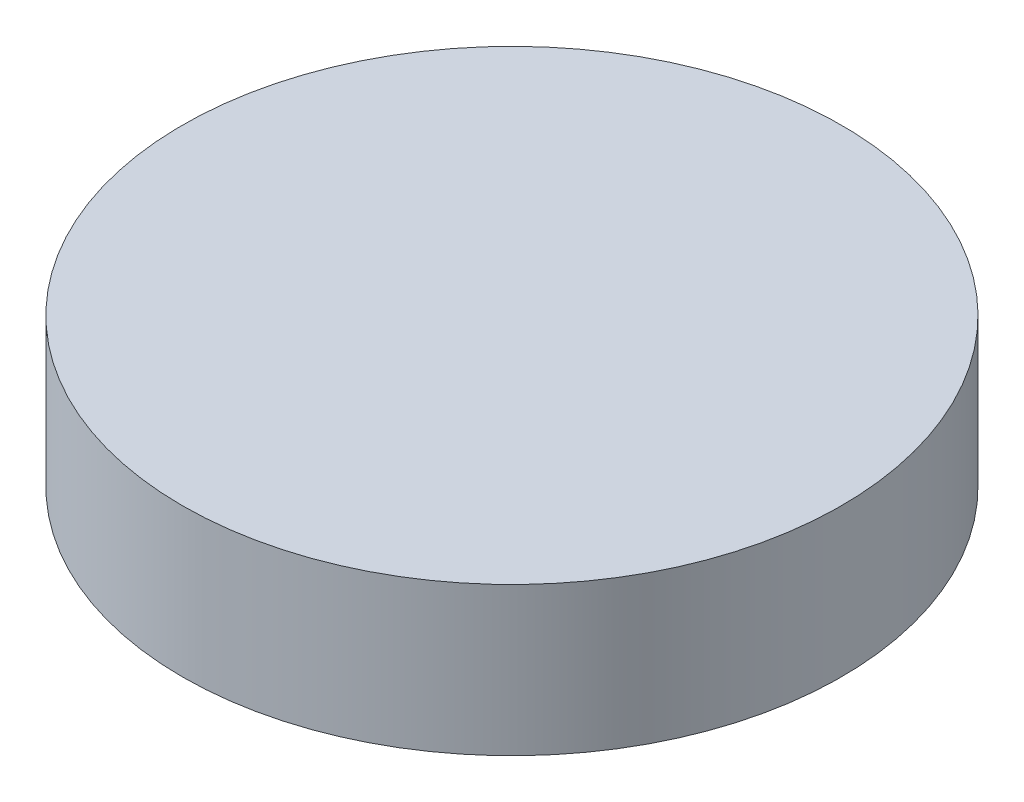
ISO-10303-21;
HEADER;
FILE_DESCRIPTION(('STEP AP214'),'2;1');
FILE_NAME('part.step','',(''),(''),'','','');
FILE_SCHEMA(('AUTOMOTIVE_DESIGN { 1 0 10303 214 1 1 1 1 }'));
ENDSEC;
DATA;
#1=APPLICATION_CONTEXT('core data for automotive mechanical design processes');
#2=APPLICATION_PROTOCOL_DEFINITION('international standard','automotive_design',2000,#1);
#3=PRODUCT_CONTEXT('',#1,'mechanical');
#4=PRODUCT('Part','Part','',(#3));
#5=PRODUCT_RELATED_PRODUCT_CATEGORY('part','',(#4));
#6=PRODUCT_DEFINITION_FORMATION('','',#4);
#7=PRODUCT_DEFINITION_CONTEXT('part definition',#1,'design');
#8=PRODUCT_DEFINITION('design','',#6,#7);
#9=PRODUCT_DEFINITION_SHAPE('','',#8);
#10=(LENGTH_UNIT() NAMED_UNIT(*) SI_UNIT(.MILLI.,.METRE.));
#11=(NAMED_UNIT(*) PLANE_ANGLE_UNIT() SI_UNIT($,.RADIAN.));
#12=(NAMED_UNIT(*) SI_UNIT($,.STERADIAN.) SOLID_ANGLE_UNIT());
#13=UNCERTAINTY_MEASURE_WITH_UNIT(LENGTH_MEASURE(1.E-05),#10,'distance_accuracy_value','');
#14=(GEOMETRIC_REPRESENTATION_CONTEXT(3) GLOBAL_UNCERTAINTY_ASSIGNED_CONTEXT((#13)) GLOBAL_UNIT_ASSIGNED_CONTEXT((#10,
#11,#12)) REPRESENTATION_CONTEXT('',''));
#15=CARTESIAN_POINT('',(0.,0.,0.));
#16=DIRECTION('',(0.,0.,1.));
#17=DIRECTION('',(1.,0.,0.));
#18=AXIS2_PLACEMENT_3D('',#15,#16,#17);
#19=CARTESIAN_POINT('',(0.,5.5118,0.));
#20=DIRECTION('',(0.,-1.,0.));
#21=DIRECTION('',(0.,0.,-1.));
#22=AXIS2_PLACEMENT_3D('',#19,#20,#21);
#23=CYLINDRICAL_SURFACE('',#22,12.25);
#24=CARTESIAN_POINT('',(0.,5.5118,0.));
#25=DIRECTION('',(0.,1.,0.));
#26=DIRECTION('',(0.,0.,1.));
#27=AXIS2_PLACEMENT_3D('',#24,#25,#26);
#28=CIRCLE('',#27,12.25);
#29=CARTESIAN_POINT('',(0.,5.5118,12.25));
#30=VERTEX_POINT('',#29);
#31=EDGE_CURVE('E10',#30,#30,#28,.T.);
#32=ORIENTED_EDGE('',*,*,#31,.F.);
#33=EDGE_LOOP('',(#32));
#34=FACE_BOUND('',#33,.T.);
#35=CARTESIAN_POINT('',(0.,0.,0.));
#36=DIRECTION('',(0.,1.,0.));
#37=DIRECTION('',(0.,0.,1.));
#38=AXIS2_PLACEMENT_3D('',#35,#36,#37);
#39=CIRCLE('',#38,12.25);
#40=CARTESIAN_POINT('',(0.,0.,12.25));
#41=VERTEX_POINT('',#40);
#42=EDGE_CURVE('E40',#41,#41,#39,.T.);
#43=ORIENTED_EDGE('',*,*,#42,.T.);
#44=EDGE_LOOP('',(#43));
#45=FACE_BOUND('',#44,.T.);
#46=ADVANCED_FACE('F37',(#34,#45),#23,.T.);
#47=CARTESIAN_POINT('',(0.,5.5118,0.));
#48=DIRECTION('',(0.,1.,0.));
#49=DIRECTION('',(0.,0.,1.));
#50=AXIS2_PLACEMENT_3D('',#47,#48,#49);
#51=PLANE('',#50);
#52=ORIENTED_EDGE('',*,*,#31,.T.);
#53=EDGE_LOOP('',(#52));
#54=FACE_BOUND('',#53,.T.);
#55=ADVANCED_FACE('F54',(#54),#51,.T.);
#56=CARTESIAN_POINT('',(0.,0.,0.));
#57=DIRECTION('',(0.,1.,0.));
#58=DIRECTION('',(0.,0.,1.));
#59=AXIS2_PLACEMENT_3D('',#56,#57,#58);
#60=PLANE('',#59);
#61=ORIENTED_EDGE('',*,*,#42,.F.);
#62=EDGE_LOOP('',(#61));
#63=FACE_BOUND('',#62,.T.);
#64=ADVANCED_FACE('F52',(#63),#60,.F.);
#65=CLOSED_SHELL('',(#46,#55,#64));
#66=MANIFOLD_SOLID_BREP('B2',#65);
#67=ADVANCED_BREP_SHAPE_REPRESENTATION('',(#18,#66),#14);
#68=SHAPE_DEFINITION_REPRESENTATION(#9,#67);
ENDSEC;
END-ISO-10303-21;
